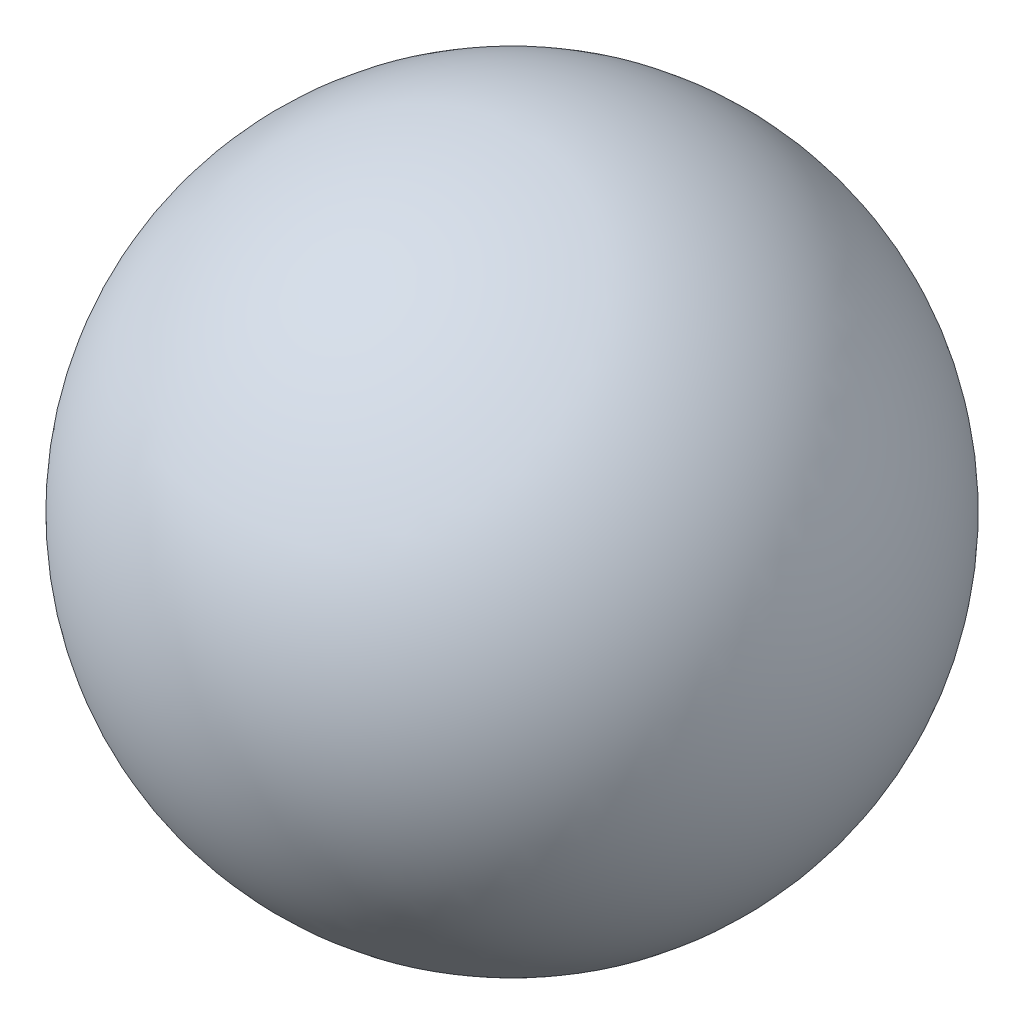
ISO-10303-21;
HEADER;
FILE_DESCRIPTION(('STEP AP214'),'2;1');
FILE_NAME('part.step','',(''),(''),'','','');
FILE_SCHEMA(('AUTOMOTIVE_DESIGN { 1 0 10303 214 1 1 1 1 }'));
ENDSEC;
DATA;
#1=APPLICATION_CONTEXT('core data for automotive mechanical design processes');
#2=APPLICATION_PROTOCOL_DEFINITION('international standard','automotive_design',2000,#1);
#3=PRODUCT_CONTEXT('',#1,'mechanical');
#4=PRODUCT('Part','Part','',(#3));
#5=PRODUCT_RELATED_PRODUCT_CATEGORY('part','',(#4));
#6=PRODUCT_DEFINITION_FORMATION('','',#4);
#7=PRODUCT_DEFINITION_CONTEXT('part definition',#1,'design');
#8=PRODUCT_DEFINITION('design','',#6,#7);
#9=PRODUCT_DEFINITION_SHAPE('','',#8);
#10=(LENGTH_UNIT() NAMED_UNIT(*) SI_UNIT(.MILLI.,.METRE.));
#11=(NAMED_UNIT(*) PLANE_ANGLE_UNIT() SI_UNIT($,.RADIAN.));
#12=(NAMED_UNIT(*) SI_UNIT($,.STERADIAN.) SOLID_ANGLE_UNIT());
#13=UNCERTAINTY_MEASURE_WITH_UNIT(LENGTH_MEASURE(1.E-05),#10,'distance_accuracy_value','');
#14=(GEOMETRIC_REPRESENTATION_CONTEXT(3) GLOBAL_UNCERTAINTY_ASSIGNED_CONTEXT((#13)) GLOBAL_UNIT_ASSIGNED_CONTEXT((#10,
#11,#12)) REPRESENTATION_CONTEXT('',''));
#15=CARTESIAN_POINT('',(0.,0.,0.));
#16=DIRECTION('',(0.,0.,1.));
#17=DIRECTION('',(1.,0.,0.));
#18=AXIS2_PLACEMENT_3D('',#15,#16,#17);
#19=CARTESIAN_POINT('',(0.,0.,0.));
#20=DIRECTION('',(0.,1.,0.));
#21=DIRECTION('',(-1.,0.,0.));
#22=AXIS2_PLACEMENT_3D('',#19,#20,#21);
#23=SPHERICAL_SURFACE('',#22,125.);
#24=CARTESIAN_POINT('',(0.,125.,0.));
#25=VERTEX_POINT('',#24);
#26=VERTEX_LOOP('',#25);
#27=FACE_BOUND('',#26,.T.);
#28=ADVANCED_FACE('F30',(#27),#23,.T.);
#29=CLOSED_SHELL('',(#28));
#30=CARTESIAN_POINT('',(0.,0.,0.));
#31=DIRECTION('',(0.,1.,0.));
#32=DIRECTION('',(-1.,0.,0.));
#33=AXIS2_PLACEMENT_3D('',#30,#31,#32);
#34=SPHERICAL_SURFACE('',#33,105.);
#35=CARTESIAN_POINT('',(0.,105.,0.));
#36=VERTEX_POINT('',#35);
#37=VERTEX_LOOP('',#36);
#38=FACE_BOUND('',#37,.T.);
#39=ADVANCED_FACE('F32',(#38),#34,.F.);
#40=CLOSED_SHELL('',(#39));
#41=ORIENTED_CLOSED_SHELL('',*,#40,.T.);
#42=BREP_WITH_VOIDS('B2',#29,(#41));
#43=ADVANCED_BREP_SHAPE_REPRESENTATION('',(#18,#42),#14);
#44=SHAPE_DEFINITION_REPRESENTATION(#9,#43);
ENDSEC;
END-ISO-10303-21;
